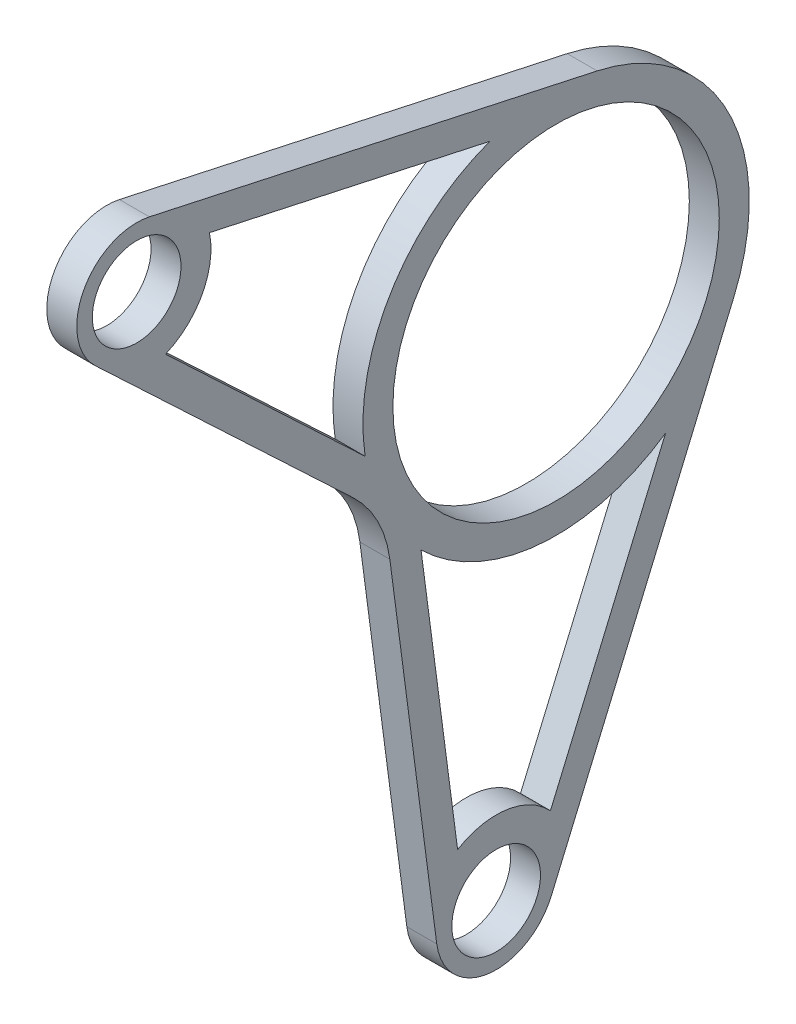
ISO-10303-21;
HEADER;
FILE_DESCRIPTION(('STEP AP214'),'2;1');
FILE_NAME('part.step','',(''),(''),'','','');
FILE_SCHEMA(('AUTOMOTIVE_DESIGN { 1 0 10303 214 1 1 1 1 }'));
ENDSEC;
DATA;
#1=APPLICATION_CONTEXT('core data for automotive mechanical design processes');
#2=APPLICATION_PROTOCOL_DEFINITION('international standard','automotive_design',2000,#1);
#3=PRODUCT_CONTEXT('',#1,'mechanical');
#4=PRODUCT('Part','Part','',(#3));
#5=PRODUCT_RELATED_PRODUCT_CATEGORY('part','',(#4));
#6=PRODUCT_DEFINITION_FORMATION('','',#4);
#7=PRODUCT_DEFINITION_CONTEXT('part definition',#1,'design');
#8=PRODUCT_DEFINITION('design','',#6,#7);
#9=PRODUCT_DEFINITION_SHAPE('','',#8);
#10=(LENGTH_UNIT() NAMED_UNIT(*) SI_UNIT(.MILLI.,.METRE.));
#11=(NAMED_UNIT(*) PLANE_ANGLE_UNIT() SI_UNIT($,.RADIAN.));
#12=(NAMED_UNIT(*) SI_UNIT($,.STERADIAN.) SOLID_ANGLE_UNIT());
#13=UNCERTAINTY_MEASURE_WITH_UNIT(LENGTH_MEASURE(1.E-05),#10,'distance_accuracy_value','');
#14=(GEOMETRIC_REPRESENTATION_CONTEXT(3) GLOBAL_UNCERTAINTY_ASSIGNED_CONTEXT((#13)) GLOBAL_UNIT_ASSIGNED_CONTEXT((#10,
#11,#12)) REPRESENTATION_CONTEXT('',''));
#15=CARTESIAN_POINT('',(0.,0.,0.));
#16=DIRECTION('',(0.,0.,1.));
#17=DIRECTION('',(1.,0.,0.));
#18=AXIS2_PLACEMENT_3D('',#15,#16,#17);
#19=CARTESIAN_POINT('',(-98.425,35.2126571367214,-267.637777540096));
#20=DIRECTION('',(0.,0.130444171254395,-0.991455656187282));
#21=DIRECTION('',(0.,0.991455656187282,0.130444171254395));
#22=AXIS2_PLACEMENT_3D('',#19,#20,#21);
#23=PLANE('',#22);
#24=DIRECTION('',(0.,-0.991455656187282,-0.130444171254395));
#25=VECTOR('',#24,1.);
#26=CARTESIAN_POINT('',(-98.425,35.2126571367214,-267.637777540096));
#27=LINE('',#26,#25);
#28=CARTESIAN_POINT('',(-98.425,213.631856854653,-244.163460259404));
#29=VERTEX_POINT('',#28);
#30=CARTESIAN_POINT('',(-98.425,138.043359025069,-254.108513166421));
#31=VERTEX_POINT('',#30);
#32=EDGE_CURVE('E227',#29,#31,#27,.T.);
#33=ORIENTED_EDGE('',*,*,#32,.F.);
#34=DIRECTION('',(-1.,0.,0.));
#35=VECTOR('',#34,1.);
#36=CARTESIAN_POINT('',(-104.775,213.631856854653,-244.163460259404));
#37=LINE('',#36,#35);
#38=CARTESIAN_POINT('',(-104.775,213.631856854653,-244.163460259404));
#39=VERTEX_POINT('',#38);
#40=EDGE_CURVE('E283',#29,#39,#37,.T.);
#41=ORIENTED_EDGE('',*,*,#40,.T.);
#42=DIRECTION('',(0.,-0.991455656187282,-0.130444171254395));
#43=VECTOR('',#42,1.);
#44=CARTESIAN_POINT('',(-104.775,35.2126571367214,-267.637777540096));
#45=LINE('',#44,#43);
#46=CARTESIAN_POINT('',(-104.775,138.043359025069,-254.108513166421));
#47=VERTEX_POINT('',#46);
#48=EDGE_CURVE('E252',#39,#47,#45,.T.);
#49=ORIENTED_EDGE('',*,*,#48,.T.);
#50=DIRECTION('',(-1.,0.,0.));
#51=VECTOR('',#50,1.);
#52=CARTESIAN_POINT('',(-98.425,138.043359025069,-254.108513166421));
#53=LINE('',#52,#51);
#54=EDGE_CURVE('E280',#31,#47,#53,.T.);
#55=ORIENTED_EDGE('',*,*,#54,.F.);
#56=EDGE_LOOP('',(#33,#41,#49,#55));
#57=FACE_BOUND('',#56,.T.);
#58=ADVANCED_FACE('F35',(#57),#23,.F.);
#59=CARTESIAN_POINT('',(-98.425,139.7,-266.7));
#60=DIRECTION('',(-1.,0.,0.));
#61=DIRECTION('',(0.,0.,1.));
#62=AXIS2_PLACEMENT_3D('',#59,#60,#61);
#63=CYLINDRICAL_SURFACE('',#62,12.7);
#64=CARTESIAN_POINT('',(-104.775,139.7,-266.7));
#65=DIRECTION('',(1.,0.,0.));
#66=DIRECTION('',(0.,0.,-1.));
#67=AXIS2_PLACEMENT_3D('',#64,#65,#66);
#68=CIRCLE('',#67,12.7);
#69=CARTESIAN_POINT('',(-104.775,134.710232546797,-278.378708009149));
#70=VERTEX_POINT('',#69);
#71=EDGE_CURVE('E254',#47,#70,#68,.T.);
#72=ORIENTED_EDGE('',*,*,#71,.T.);
#73=DIRECTION('',(-1.,0.,0.));
#74=VECTOR('',#73,1.);
#75=CARTESIAN_POINT('',(-98.425,134.710232546797,-278.378708009149));
#76=LINE('',#75,#74);
#77=CARTESIAN_POINT('',(-98.425,134.710232546797,-278.378708009149));
#78=VERTEX_POINT('',#77);
#79=EDGE_CURVE('E277',#78,#70,#76,.T.);
#80=ORIENTED_EDGE('',*,*,#79,.F.);
#81=CARTESIAN_POINT('',(-98.425,139.7,-266.7));
#82=DIRECTION('',(1.,0.,0.));
#83=DIRECTION('',(0.,0.,-1.));
#84=AXIS2_PLACEMENT_3D('',#81,#82,#83);
#85=CIRCLE('',#84,12.7);
#86=EDGE_CURVE('E229',#31,#78,#85,.T.);
#87=ORIENTED_EDGE('',*,*,#86,.F.);
#88=ORIENTED_EDGE('',*,*,#54,.T.);
#89=EDGE_LOOP('',(#72,#80,#87,#88));
#90=FACE_BOUND('',#89,.T.);
#91=ADVANCED_FACE('F307',(#90),#63,.T.);
#92=CARTESIAN_POINT('',(-98.425,-79.7834058707051,-186.735576332567));
#93=DIRECTION('',(0.,0.392895075055363,0.919583307806987));
#94=DIRECTION('',(0.,-0.919583307806987,0.392895075055363));
#95=AXIS2_PLACEMENT_3D('',#92,#93,#94);
#96=PLANE('',#95);
#97=DIRECTION('',(0.,0.919583307806987,-0.392895075055363));
#98=VECTOR('',#97,1.);
#99=CARTESIAN_POINT('',(-104.775,-79.7834058707051,-186.735576332567));
#100=LINE('',#99,#98);
#101=CARTESIAN_POINT('',(-104.775,225.215098942321,-317.047217945617));
#102=VERTEX_POINT('',#101);
#103=EDGE_CURVE('E256',#70,#102,#100,.T.);
#104=ORIENTED_EDGE('',*,*,#103,.T.);
#105=DIRECTION('',(-1.,0.,0.));
#106=VECTOR('',#105,1.);
#107=CARTESIAN_POINT('',(-98.425,225.215098942321,-317.047217945617));
#108=LINE('',#107,#106);
#109=CARTESIAN_POINT('',(-98.425,225.215098942321,-317.047217945617));
#110=VERTEX_POINT('',#109);
#111=EDGE_CURVE('E275',#110,#102,#108,.T.);
#112=ORIENTED_EDGE('',*,*,#111,.F.);
#113=DIRECTION('',(0.,0.919583307806987,-0.392895075055363));
#114=VECTOR('',#113,1.);
#115=CARTESIAN_POINT('',(-98.425,-79.7834058707051,-186.735576332567));
#116=LINE('',#115,#114);
#117=EDGE_CURVE('E231',#78,#110,#116,.T.);
#118=ORIENTED_EDGE('',*,*,#117,.F.);
#119=ORIENTED_EDGE('',*,*,#79,.T.);
#120=EDGE_LOOP('',(#104,#112,#118,#119));
#121=FACE_BOUND('',#120,.T.);
#122=ADVANCED_FACE('F313',(#121),#96,.F.);
#123=CARTESIAN_POINT('',(-98.425,241.3,-279.4));
#124=DIRECTION('',(-1.,0.,0.));
#125=DIRECTION('',(0.,0.,1.));
#126=AXIS2_PLACEMENT_3D('',#123,#124,#125);
#127=CYLINDRICAL_SURFACE('',#126,40.9394316164762);
#128=CARTESIAN_POINT('',(-104.775,241.3,-279.4));
#129=DIRECTION('',(1.,0.,0.));
#130=DIRECTION('',(0.,0.,-1.));
#131=AXIS2_PLACEMENT_3D('',#128,#129,#130);
#132=CIRCLE('',#131,40.9394316164762);
#133=CARTESIAN_POINT('',(-104.775,281.30198878663,-288.110795267625));
#134=VERTEX_POINT('',#133);
#135=EDGE_CURVE('E259',#134,#102,#132,.F.);
#136=ORIENTED_EDGE('',*,*,#135,.F.);
#137=DIRECTION('',(-1.,0.,0.));
#138=VECTOR('',#137,1.);
#139=CARTESIAN_POINT('',(-98.425,281.30198878663,-288.110795267625));
#140=LINE('',#139,#138);
#141=CARTESIAN_POINT('',(-98.425,281.30198878663,-288.110795267625));
#142=VERTEX_POINT('',#141);
#143=EDGE_CURVE('E273',#142,#134,#140,.T.);
#144=ORIENTED_EDGE('',*,*,#143,.F.);
#145=CARTESIAN_POINT('',(-98.425,241.3,-279.4));
#146=DIRECTION('',(1.,0.,0.));
#147=DIRECTION('',(0.,0.,-1.));
#148=AXIS2_PLACEMENT_3D('',#145,#146,#147);
#149=CIRCLE('',#148,40.9394316164762);
#150=EDGE_CURVE('E233',#142,#110,#149,.F.);
#151=ORIENTED_EDGE('',*,*,#150,.T.);
#152=ORIENTED_EDGE('',*,*,#111,.T.);
#153=EDGE_LOOP('',(#136,#144,#151,#152));
#154=FACE_BOUND('',#153,.T.);
#155=ADVANCED_FACE('F317',(#154),#127,.T.);
#156=CARTESIAN_POINT('',(-98.425,328.465228610363,-71.5262777113434));
#157=DIRECTION('',(0.,-0.977101713608814,0.212772745582509));
#158=DIRECTION('',(0.,-0.212772745582509,-0.977101713608814));
#159=AXIS2_PLACEMENT_3D('',#156,#157,#158);
#160=PLANE('',#159);
#161=DIRECTION('',(0.,0.21277274558251,0.977101713608814));
#162=VECTOR('',#161,1.);
#163=CARTESIAN_POINT('',(-104.775,328.465228610363,-71.5262777113434));
#164=LINE('',#163,#162);
#165=CARTESIAN_POINT('',(-104.775,301.969191762832,-193.202213868898));
#166=VERTEX_POINT('',#165);
#167=EDGE_CURVE('E262',#134,#166,#164,.T.);
#168=ORIENTED_EDGE('',*,*,#167,.T.);
#169=DIRECTION('',(-1.,0.,0.));
#170=VECTOR('',#169,1.);
#171=CARTESIAN_POINT('',(-98.425,301.969191762832,-193.202213868898));
#172=LINE('',#171,#170);
#173=CARTESIAN_POINT('',(-98.425,301.969191762832,-193.202213868898));
#174=VERTEX_POINT('',#173);
#175=EDGE_CURVE('E270',#174,#166,#172,.T.);
#176=ORIENTED_EDGE('',*,*,#175,.F.);
#177=DIRECTION('',(0.,0.21277274558251,0.977101713608814));
#178=VECTOR('',#177,1.);
#179=CARTESIAN_POINT('',(-98.425,328.465228610363,-71.5262777113434));
#180=LINE('',#179,#178);
#181=EDGE_CURVE('E236',#142,#174,#180,.T.);
#182=ORIENTED_EDGE('',*,*,#181,.F.);
#183=ORIENTED_EDGE('',*,*,#143,.T.);
#184=EDGE_LOOP('',(#168,#176,#182,#183));
#185=FACE_BOUND('',#184,.T.);
#186=ADVANCED_FACE('F322',(#185),#160,.F.);
#187=CARTESIAN_POINT('',(-98.425,289.56,-190.5));
#188=DIRECTION('',(-1.,0.,0.));
#189=DIRECTION('',(0.,0.,1.));
#190=AXIS2_PLACEMENT_3D('',#187,#188,#189);
#191=CYLINDRICAL_SURFACE('',#190,12.7);
#192=CARTESIAN_POINT('',(-104.775,289.56,-190.5));
#193=DIRECTION('',(1.,0.,0.));
#194=DIRECTION('',(0.,0.,-1.));
#195=AXIS2_PLACEMENT_3D('',#192,#193,#194);
#196=CIRCLE('',#195,12.7);
#197=CARTESIAN_POINT('',(-104.775,280.321615273653,-181.78551506697));
#198=VERTEX_POINT('',#197);
#199=EDGE_CURVE('E264',#166,#198,#196,.T.);
#200=ORIENTED_EDGE('',*,*,#199,.T.);
#201=DIRECTION('',(-1.,0.,0.));
#202=VECTOR('',#201,1.);
#203=CARTESIAN_POINT('',(-98.425,280.321615273653,-181.78551506697));
#204=LINE('',#203,#202);
#205=CARTESIAN_POINT('',(-98.425,280.321615273653,-181.78551506697));
#206=VERTEX_POINT('',#205);
#207=EDGE_CURVE('E243',#206,#198,#204,.T.);
#208=ORIENTED_EDGE('',*,*,#207,.F.);
#209=CARTESIAN_POINT('',(-98.425,289.56,-190.5));
#210=DIRECTION('',(1.,0.,0.));
#211=DIRECTION('',(0.,0.,-1.));
#212=AXIS2_PLACEMENT_3D('',#209,#210,#211);
#213=CIRCLE('',#212,12.7);
#214=EDGE_CURVE('E238',#174,#206,#213,.T.);
#215=ORIENTED_EDGE('',*,*,#214,.F.);
#216=ORIENTED_EDGE('',*,*,#175,.T.);
#217=EDGE_LOOP('',(#200,#208,#215,#216));
#218=FACE_BOUND('',#217,.T.);
#219=ADVANCED_FACE('F325',(#218),#191,.T.);
#220=CARTESIAN_POINT('',(-98.425,289.56,-190.5));
#221=DIRECTION('',(-1.,0.,0.));
#222=DIRECTION('',(0.,0.,1.));
#223=AXIS2_PLACEMENT_3D('',#220,#221,#222);
#224=CYLINDRICAL_SURFACE('',#223,9.39799999999998);
#225=CARTESIAN_POINT('',(-98.425,289.56,-190.5));
#226=DIRECTION('',(1.,0.,0.));
#227=DIRECTION('',(0.,0.,-1.));
#228=AXIS2_PLACEMENT_3D('',#225,#226,#227);
#229=CIRCLE('',#228,9.39799999999998);
#230=CARTESIAN_POINT('',(-98.425,289.56,-199.898));
#231=VERTEX_POINT('',#230);
#232=EDGE_CURVE('E224',#231,#231,#229,.T.);
#233=ORIENTED_EDGE('',*,*,#232,.T.);
#234=EDGE_LOOP('',(#233));
#235=FACE_BOUND('',#234,.T.);
#236=CARTESIAN_POINT('',(-104.775,289.56,-190.5));
#237=DIRECTION('',(1.,0.,0.));
#238=DIRECTION('',(0.,0.,-1.));
#239=AXIS2_PLACEMENT_3D('',#236,#237,#238);
#240=CIRCLE('',#239,9.39799999999998);
#241=CARTESIAN_POINT('',(-104.775,289.56,-199.898));
#242=VERTEX_POINT('',#241);
#243=EDGE_CURVE('E249',#242,#242,#240,.T.);
#244=ORIENTED_EDGE('',*,*,#243,.F.);
#245=EDGE_LOOP('',(#244));
#246=FACE_BOUND('',#245,.T.);
#247=ADVANCED_FACE('F327',(#235,#246),#224,.F.);
#248=CARTESIAN_POINT('',(-98.425,241.3,-279.4));
#249=DIRECTION('',(-1.,0.,0.));
#250=DIRECTION('',(0.,0.,1.));
#251=AXIS2_PLACEMENT_3D('',#248,#249,#250);
#252=CYLINDRICAL_SURFACE('',#251,34.5894316164762);
#253=CARTESIAN_POINT('',(-98.425,241.3,-279.4));
#254=DIRECTION('',(1.,0.,0.));
#255=DIRECTION('',(0.,0.,-1.));
#256=AXIS2_PLACEMENT_3D('',#253,#254,#255);
#257=CIRCLE('',#256,34.5894316164762);
#258=CARTESIAN_POINT('',(-98.425,241.3,-313.989431616476));
#259=VERTEX_POINT('',#258);
#260=EDGE_CURVE('E220',#259,#259,#257,.T.);
#261=ORIENTED_EDGE('',*,*,#260,.T.);
#262=EDGE_LOOP('',(#261));
#263=FACE_BOUND('',#262,.T.);
#264=CARTESIAN_POINT('',(-104.775,241.3,-279.4));
#265=DIRECTION('',(1.,0.,0.));
#266=DIRECTION('',(0.,0.,-1.));
#267=AXIS2_PLACEMENT_3D('',#264,#265,#266);
#268=CIRCLE('',#267,34.5894316164762);
#269=CARTESIAN_POINT('',(-104.775,241.3,-313.989431616476));
#270=VERTEX_POINT('',#269);
#271=EDGE_CURVE('E246',#270,#270,#268,.T.);
#272=ORIENTED_EDGE('',*,*,#271,.F.);
#273=EDGE_LOOP('',(#272));
#274=FACE_BOUND('',#273,.T.);
#275=ADVANCED_FACE('F333',(#263,#274),#252,.F.);
#276=CARTESIAN_POINT('',(-98.425,139.7,-266.7));
#277=DIRECTION('',(-1.,0.,0.));
#278=DIRECTION('',(0.,0.,1.));
#279=AXIS2_PLACEMENT_3D('',#276,#277,#278);
#280=CYLINDRICAL_SURFACE('',#279,9.39800000000001);
#281=CARTESIAN_POINT('',(-98.425,139.7,-266.7));
#282=DIRECTION('',(1.,0.,0.));
#283=DIRECTION('',(0.,0.,-1.));
#284=AXIS2_PLACEMENT_3D('',#281,#282,#283);
#285=CIRCLE('',#284,9.39800000000001);
#286=CARTESIAN_POINT('',(-98.425,139.7,-276.098));
#287=VERTEX_POINT('',#286);
#288=EDGE_CURVE('E217',#287,#287,#285,.T.);
#289=ORIENTED_EDGE('',*,*,#288,.T.);
#290=EDGE_LOOP('',(#289));
#291=FACE_BOUND('',#290,.T.);
#292=CARTESIAN_POINT('',(-104.775,139.7,-266.7));
#293=DIRECTION('',(1.,0.,0.));
#294=DIRECTION('',(0.,0.,-1.));
#295=AXIS2_PLACEMENT_3D('',#292,#293,#294);
#296=CIRCLE('',#295,9.39800000000001);
#297=CARTESIAN_POINT('',(-104.775,139.7,-276.098));
#298=VERTEX_POINT('',#297);
#299=EDGE_CURVE('E184',#298,#298,#296,.T.);
#300=ORIENTED_EDGE('',*,*,#299,.F.);
#301=EDGE_LOOP('',(#300));
#302=FACE_BOUND('',#301,.T.);
#303=ADVANCED_FACE('F347',(#291,#302),#280,.F.);
#304=CARTESIAN_POINT('',(-98.425,239.072262610238,-225.514707617753));
#305=DIRECTION('',(0.,0.727431868216255,-0.686179915986623));
#306=DIRECTION('',(0.,0.686179915986623,0.727431868216255));
#307=AXIS2_PLACEMENT_3D('',#304,#305,#306);
#308=PLANE('',#307);
#309=DIRECTION('',(0.,-0.686179915986623,-0.727431868216255));
#310=VECTOR('',#309,1.);
#311=CARTESIAN_POINT('',(-104.775,239.072262610238,-225.514707617753));
#312=LINE('',#311,#310);
#313=CARTESIAN_POINT('',(-104.775,228.795344357484,-236.409456458307));
#314=VERTEX_POINT('',#313);
#315=EDGE_CURVE('E221',#198,#314,#312,.T.);
#316=ORIENTED_EDGE('',*,*,#315,.T.);
#317=DIRECTION('',(-1.,0.,0.));
#318=VECTOR('',#317,1.);
#319=CARTESIAN_POINT('',(-98.425,228.795344357484,-236.409456458307));
#320=LINE('',#319,#318);
#321=CARTESIAN_POINT('',(-98.425,228.795344357484,-236.409456458307));
#322=VERTEX_POINT('',#321);
#323=EDGE_CURVE('E286',#314,#322,#320,.F.);
#324=ORIENTED_EDGE('',*,*,#323,.T.);
#325=DIRECTION('',(0.,-0.686179915986623,-0.727431868216255));
#326=VECTOR('',#325,1.);
#327=CARTESIAN_POINT('',(-98.425,239.072262610238,-225.514707617753));
#328=LINE('',#327,#326);
#329=EDGE_CURVE('E240',#206,#322,#328,.T.);
#330=ORIENTED_EDGE('',*,*,#329,.F.);
#331=ORIENTED_EDGE('',*,*,#207,.T.);
#332=EDGE_LOOP('',(#316,#324,#330,#331));
#333=FACE_BOUND('',#332,.T.);
#334=ADVANCED_FACE('F296',(#333),#308,.F.);
#335=CARTESIAN_POINT('',(-98.425,0.,0.));
#336=DIRECTION('',(1.,0.,0.));
#337=DIRECTION('',(0.,0.,-1.));
#338=AXIS2_PLACEMENT_3D('',#335,#336,#337);
#339=PLANE('',#338);
#340=CARTESIAN_POINT('',(-98.425,289.56,-190.5));
#341=DIRECTION('',(-1.,0.,0.));
#342=DIRECTION('',(0.,0.,1.));
#343=AXIS2_PLACEMENT_3D('',#340,#341,#342);
#344=CIRCLE('',#343,15.748);
#345=CARTESIAN_POINT('',(-98.425,292.698327232095,-205.932122543069));
#346=VERTEX_POINT('',#345);
#347=CARTESIAN_POINT('',(-98.425,275.052266891521,-196.625780281167));
#348=VERTEX_POINT('',#347);
#349=EDGE_CURVE('E50',#346,#348,#344,.T.);
#350=ORIENTED_EDGE('',*,*,#349,.F.);
#351=DIRECTION('',(0.,0.212772745582508,0.977101713608814));
#352=VECTOR('',#351,1.);
#353=CARTESIAN_POINT('',(-98.425,279.757107685433,-265.361199141267));
#354=LINE('',#353,#352);
#355=CARTESIAN_POINT('',(-98.425,279.757107685433,-265.361199141267));
#356=VERTEX_POINT('',#355);
#357=EDGE_CURVE('E168',#356,#346,#354,.T.);
#358=ORIENTED_EDGE('',*,*,#357,.F.);
#359=CARTESIAN_POINT('',(-98.425,241.3,-279.4));
#360=DIRECTION('',(-1.,0.,0.));
#361=DIRECTION('',(0.,0.,-1.));
#362=AXIS2_PLACEMENT_3D('',#359,#360,#361);
#363=CIRCLE('',#362,40.9394316164762);
#364=CARTESIAN_POINT('',(-98.425,235.151944416099,-238.924841277428));
#365=VERTEX_POINT('',#364);
#366=EDGE_CURVE('E171',#365,#356,#363,.T.);
#367=ORIENTED_EDGE('',*,*,#366,.F.);
#368=DIRECTION('',(0.,-0.686179915986624,-0.727431868216254));
#369=VECTOR('',#368,1.);
#370=CARTESIAN_POINT('',(-98.425,275.052266891521,-196.625780281167));
#371=LINE('',#370,#369);
#372=EDGE_CURVE('E177',#348,#365,#371,.T.);
#373=ORIENTED_EDGE('',*,*,#372,.F.);
#374=EDGE_LOOP('',(#350,#358,#367,#373));
#375=FACE_BOUND('',#374,.T.);
#376=CARTESIAN_POINT('',(-98.425,241.3,-279.4));
#377=DIRECTION('',(-1.,0.,0.));
#378=DIRECTION('',(0.,0.,-1.));
#379=AXIS2_PLACEMENT_3D('',#376,#377,#378);
#380=CIRCLE('',#379,40.9394316164762);
#381=CARTESIAN_POINT('',(-98.425,207.571144307365,-302.603477212383));
#382=VERTEX_POINT('',#381);
#383=CARTESIAN_POINT('',(-98.425,212.027275618194,-250.779296508525));
#384=VERTEX_POINT('',#383);
#385=EDGE_CURVE('E58',#382,#384,#380,.T.);
#386=ORIENTED_EDGE('',*,*,#385,.F.);
#387=DIRECTION('',(0.,0.919583307806988,-0.392895075055362));
#388=VECTOR('',#387,1.);
#389=CARTESIAN_POINT('',(-98.425,150.45723397037,-278.201366062635));
#390=LINE('',#389,#388);
#391=CARTESIAN_POINT('',(-98.425,150.45723397037,-278.201366062635));
#392=VERTEX_POINT('',#391);
#393=EDGE_CURVE('E192',#392,#382,#390,.T.);
#394=ORIENTED_EDGE('',*,*,#393,.F.);
#395=CARTESIAN_POINT('',(-98.425,139.7,-266.7));
#396=DIRECTION('',(-1.,0.,0.));
#397=DIRECTION('',(0.,0.,1.));
#398=AXIS2_PLACEMENT_3D('',#395,#396,#397);
#399=CIRCLE('',#398,15.748);
#400=CARTESIAN_POINT('',(-98.425,153.159549828988,-258.524425255618));
#401=VERTEX_POINT('',#400);
#402=EDGE_CURVE('E206',#401,#392,#399,.T.);
#403=ORIENTED_EDGE('',*,*,#402,.F.);
#404=DIRECTION('',(0.,-0.991455656187282,-0.130444171254395));
#405=VECTOR('',#404,1.);
#406=CARTESIAN_POINT('',(-98.425,212.027275618193,-250.779296508525));
#407=LINE('',#406,#405);
#408=EDGE_CURVE('E203',#384,#401,#407,.T.);
#409=ORIENTED_EDGE('',*,*,#408,.F.);
#410=EDGE_LOOP('',(#386,#394,#403,#409));
#411=FACE_BOUND('',#410,.T.);
#412=ORIENTED_EDGE('',*,*,#288,.F.);
#413=EDGE_LOOP('',(#412));
#414=FACE_BOUND('',#413,.T.);
#415=ORIENTED_EDGE('',*,*,#260,.F.);
#416=EDGE_LOOP('',(#415));
#417=FACE_BOUND('',#416,.T.);
#418=ORIENTED_EDGE('',*,*,#232,.F.);
#419=EDGE_LOOP('',(#418));
#420=FACE_BOUND('',#419,.T.);
#421=ORIENTED_EDGE('',*,*,#329,.T.);
#422=CARTESIAN_POINT('',(-98.425,210.318574904791,-218.980486592247));
#423=DIRECTION('',(1.,0.,0.));
#424=DIRECTION('',(0.,0.,-1.));
#425=AXIS2_PLACEMENT_3D('',#422,#423,#424);
#426=CIRCLE('',#425,25.4);
#427=EDGE_CURVE('E11',#322,#29,#426,.F.);
#428=ORIENTED_EDGE('',*,*,#427,.T.);
#429=ORIENTED_EDGE('',*,*,#32,.T.);
#430=ORIENTED_EDGE('',*,*,#86,.T.);
#431=ORIENTED_EDGE('',*,*,#117,.T.);
#432=ORIENTED_EDGE('',*,*,#150,.F.);
#433=ORIENTED_EDGE('',*,*,#181,.T.);
#434=ORIENTED_EDGE('',*,*,#214,.T.);
#435=EDGE_LOOP('',(#421,#428,#429,#430,#431,#432,#433,#434));
#436=FACE_BOUND('',#435,.T.);
#437=ADVANCED_FACE('F302',(#375,#411,#414,#417,#420,#436),#339,.T.);
#438=CARTESIAN_POINT('',(-104.775,0.,0.));
#439=DIRECTION('',(1.,0.,0.));
#440=DIRECTION('',(0.,0.,-1.));
#441=AXIS2_PLACEMENT_3D('',#438,#439,#440);
#442=PLANE('',#441);
#443=DIRECTION('',(0.,0.212772745582508,0.977101713608814));
#444=VECTOR('',#443,1.);
#445=CARTESIAN_POINT('',(-104.775,279.757107685433,-265.361199141267));
#446=LINE('',#445,#444);
#447=CARTESIAN_POINT('',(-104.775,279.757107685433,-265.361199141267));
#448=VERTEX_POINT('',#447);
#449=CARTESIAN_POINT('',(-104.775,292.698327232095,-205.932122543069));
#450=VERTEX_POINT('',#449);
#451=EDGE_CURVE('E155',#448,#450,#446,.T.);
#452=ORIENTED_EDGE('',*,*,#451,.T.);
#453=CARTESIAN_POINT('',(-104.775,289.56,-190.5));
#454=DIRECTION('',(-1.,0.,0.));
#455=DIRECTION('',(0.,0.,1.));
#456=AXIS2_PLACEMENT_3D('',#453,#454,#455);
#457=CIRCLE('',#456,15.748);
#458=CARTESIAN_POINT('',(-104.775,275.052266891521,-196.625780281167));
#459=VERTEX_POINT('',#458);
#460=EDGE_CURVE('E149',#450,#459,#457,.T.);
#461=ORIENTED_EDGE('',*,*,#460,.T.);
#462=DIRECTION('',(0.,-0.686179915986624,-0.727431868216254));
#463=VECTOR('',#462,1.);
#464=CARTESIAN_POINT('',(-104.775,275.052266891521,-196.625780281167));
#465=LINE('',#464,#463);
#466=CARTESIAN_POINT('',(-104.775,235.151944416098,-238.924841277428));
#467=VERTEX_POINT('',#466);
#468=EDGE_CURVE('E159',#459,#467,#465,.T.);
#469=ORIENTED_EDGE('',*,*,#468,.T.);
#470=CARTESIAN_POINT('',(-104.775,241.3,-279.4));
#471=DIRECTION('',(-1.,0.,0.));
#472=DIRECTION('',(0.,0.,-1.));
#473=AXIS2_PLACEMENT_3D('',#470,#471,#472);
#474=CIRCLE('',#473,40.9394316164762);
#475=EDGE_CURVE('E163',#467,#448,#474,.T.);
#476=ORIENTED_EDGE('',*,*,#475,.T.);
#477=EDGE_LOOP('',(#452,#461,#469,#476));
#478=FACE_BOUND('',#477,.T.);
#479=DIRECTION('',(0.,0.919583307806988,-0.392895075055362));
#480=VECTOR('',#479,1.);
#481=CARTESIAN_POINT('',(-104.775,150.45723397037,-278.201366062635));
#482=LINE('',#481,#480);
#483=CARTESIAN_POINT('',(-104.775,150.45723397037,-278.201366062635));
#484=VERTEX_POINT('',#483);
#485=CARTESIAN_POINT('',(-104.775,207.571144307365,-302.603477212383));
#486=VERTEX_POINT('',#485);
#487=EDGE_CURVE('E198',#484,#486,#482,.T.);
#488=ORIENTED_EDGE('',*,*,#487,.T.);
#489=CARTESIAN_POINT('',(-104.775,241.3,-279.4));
#490=DIRECTION('',(-1.,0.,0.));
#491=DIRECTION('',(0.,0.,-1.));
#492=AXIS2_PLACEMENT_3D('',#489,#490,#491);
#493=CIRCLE('',#492,40.9394316164762);
#494=CARTESIAN_POINT('',(-104.775,212.027275618193,-250.779296508525));
#495=VERTEX_POINT('',#494);
#496=EDGE_CURVE('E188',#486,#495,#493,.T.);
#497=ORIENTED_EDGE('',*,*,#496,.T.);
#498=DIRECTION('',(0.,-0.991455656187282,-0.130444171254395));
#499=VECTOR('',#498,1.);
#500=CARTESIAN_POINT('',(-104.775,212.027275618193,-250.779296508525));
#501=LINE('',#500,#499);
#502=CARTESIAN_POINT('',(-104.775,153.159549828988,-258.524425255618));
#503=VERTEX_POINT('',#502);
#504=EDGE_CURVE('E191',#495,#503,#501,.T.);
#505=ORIENTED_EDGE('',*,*,#504,.T.);
#506=CARTESIAN_POINT('',(-104.775,139.7,-266.7));
#507=DIRECTION('',(-1.,0.,0.));
#508=DIRECTION('',(0.,0.,1.));
#509=AXIS2_PLACEMENT_3D('',#506,#507,#508);
#510=CIRCLE('',#509,15.748);
#511=EDGE_CURVE('E195',#503,#484,#510,.T.);
#512=ORIENTED_EDGE('',*,*,#511,.T.);
#513=EDGE_LOOP('',(#488,#497,#505,#512));
#514=FACE_BOUND('',#513,.T.);
#515=ORIENTED_EDGE('',*,*,#299,.T.);
#516=EDGE_LOOP('',(#515));
#517=FACE_BOUND('',#516,.T.);
#518=ORIENTED_EDGE('',*,*,#271,.T.);
#519=EDGE_LOOP('',(#518));
#520=FACE_BOUND('',#519,.T.);
#521=ORIENTED_EDGE('',*,*,#243,.T.);
#522=EDGE_LOOP('',(#521));
#523=FACE_BOUND('',#522,.T.);
#524=ORIENTED_EDGE('',*,*,#48,.F.);
#525=CARTESIAN_POINT('',(-104.775,210.318574904791,-218.980486592247));
#526=DIRECTION('',(1.,0.,0.));
#527=DIRECTION('',(0.,0.,-1.));
#528=AXIS2_PLACEMENT_3D('',#525,#526,#527);
#529=CIRCLE('',#528,25.4);
#530=EDGE_CURVE('E43',#39,#314,#529,.T.);
#531=ORIENTED_EDGE('',*,*,#530,.T.);
#532=ORIENTED_EDGE('',*,*,#315,.F.);
#533=ORIENTED_EDGE('',*,*,#199,.F.);
#534=ORIENTED_EDGE('',*,*,#167,.F.);
#535=ORIENTED_EDGE('',*,*,#135,.T.);
#536=ORIENTED_EDGE('',*,*,#103,.F.);
#537=ORIENTED_EDGE('',*,*,#71,.F.);
#538=EDGE_LOOP('',(#524,#531,#532,#533,#534,#535,#536,#537));
#539=FACE_BOUND('',#538,.T.);
#540=ADVANCED_FACE('F165',(#478,#514,#517,#520,#523,#539),#442,.F.);
#541=CARTESIAN_POINT('',(-98.425,210.318574904791,-218.980486592247));
#542=DIRECTION('',(1.,0.,0.));
#543=DIRECTION('',(0.,0.,-1.));
#544=AXIS2_PLACEMENT_3D('',#541,#542,#543);
#545=CYLINDRICAL_SURFACE('',#544,25.4);
#546=ORIENTED_EDGE('',*,*,#427,.F.);
#547=ORIENTED_EDGE('',*,*,#323,.F.);
#548=ORIENTED_EDGE('',*,*,#530,.F.);
#549=ORIENTED_EDGE('',*,*,#40,.F.);
#550=EDGE_LOOP('',(#546,#547,#548,#549));
#551=FACE_BOUND('',#550,.T.);
#552=ADVANCED_FACE('F37',(#551),#545,.F.);
#553=CARTESIAN_POINT('',(-104.775,241.3,-279.4));
#554=DIRECTION('',(1.,0.,0.));
#555=DIRECTION('',(0.,0.,-1.));
#556=AXIS2_PLACEMENT_3D('',#553,#554,#555);
#557=CYLINDRICAL_SURFACE('',#556,40.9394316164762);
#558=ORIENTED_EDGE('',*,*,#385,.T.);
#559=DIRECTION('',(1.,0.,0.));
#560=VECTOR('',#559,1.);
#561=CARTESIAN_POINT('',(-104.775,212.027275618193,-250.779296508525));
#562=LINE('',#561,#560);
#563=EDGE_CURVE('E201',#495,#384,#562,.T.);
#564=ORIENTED_EDGE('',*,*,#563,.F.);
#565=ORIENTED_EDGE('',*,*,#496,.F.);
#566=DIRECTION('',(1.,0.,0.));
#567=VECTOR('',#566,1.);
#568=CARTESIAN_POINT('',(-104.775,207.571144307365,-302.603477212383));
#569=LINE('',#568,#567);
#570=EDGE_CURVE('E178',#486,#382,#569,.T.);
#571=ORIENTED_EDGE('',*,*,#570,.T.);
#572=EDGE_LOOP('',(#558,#564,#565,#571));
#573=FACE_BOUND('',#572,.T.);
#574=ADVANCED_FACE('F370',(#573),#557,.T.);
#575=CARTESIAN_POINT('',(-104.775,150.45723397037,-278.201366062635));
#576=DIRECTION('',(0.,-0.392895075055362,-0.919583307806988));
#577=DIRECTION('',(0.,0.919583307806988,-0.392895075055362));
#578=AXIS2_PLACEMENT_3D('',#575,#576,#577);
#579=PLANE('',#578);
#580=ORIENTED_EDGE('',*,*,#393,.T.);
#581=ORIENTED_EDGE('',*,*,#570,.F.);
#582=ORIENTED_EDGE('',*,*,#487,.F.);
#583=DIRECTION('',(1.,0.,0.));
#584=VECTOR('',#583,1.);
#585=CARTESIAN_POINT('',(-104.775,150.45723397037,-278.201366062635));
#586=LINE('',#585,#584);
#587=EDGE_CURVE('E212',#484,#392,#586,.T.);
#588=ORIENTED_EDGE('',*,*,#587,.T.);
#589=EDGE_LOOP('',(#580,#581,#582,#588));
#590=FACE_BOUND('',#589,.T.);
#591=ADVANCED_FACE('F376',(#590),#579,.F.);
#592=CARTESIAN_POINT('',(-104.775,139.7,-266.7));
#593=DIRECTION('',(1.,0.,0.));
#594=DIRECTION('',(0.,0.,-1.));
#595=AXIS2_PLACEMENT_3D('',#592,#593,#594);
#596=CYLINDRICAL_SURFACE('',#595,15.748);
#597=ORIENTED_EDGE('',*,*,#402,.T.);
#598=ORIENTED_EDGE('',*,*,#587,.F.);
#599=ORIENTED_EDGE('',*,*,#511,.F.);
#600=DIRECTION('',(1.,0.,0.));
#601=VECTOR('',#600,1.);
#602=CARTESIAN_POINT('',(-104.775,153.159549828988,-258.524425255618));
#603=LINE('',#602,#601);
#604=EDGE_CURVE('E214',#503,#401,#603,.T.);
#605=ORIENTED_EDGE('',*,*,#604,.T.);
#606=EDGE_LOOP('',(#597,#598,#599,#605));
#607=FACE_BOUND('',#606,.T.);
#608=ADVANCED_FACE('F380',(#607),#596,.T.);
#609=CARTESIAN_POINT('',(-104.775,212.027275618193,-250.779296508525));
#610=DIRECTION('',(0.,-0.130444171254395,0.991455656187282));
#611=DIRECTION('',(0.,-0.991455656187282,-0.130444171254395));
#612=AXIS2_PLACEMENT_3D('',#609,#610,#611);
#613=PLANE('',#612);
#614=ORIENTED_EDGE('',*,*,#408,.T.);
#615=ORIENTED_EDGE('',*,*,#604,.F.);
#616=ORIENTED_EDGE('',*,*,#504,.F.);
#617=ORIENTED_EDGE('',*,*,#563,.T.);
#618=EDGE_LOOP('',(#614,#615,#616,#617));
#619=FACE_BOUND('',#618,.T.);
#620=ADVANCED_FACE('F377',(#619),#613,.F.);
#621=CARTESIAN_POINT('',(-104.775,289.56,-190.5));
#622=DIRECTION('',(1.,0.,0.));
#623=DIRECTION('',(0.,0.,-1.));
#624=AXIS2_PLACEMENT_3D('',#621,#622,#623);
#625=CYLINDRICAL_SURFACE('',#624,15.748);
#626=ORIENTED_EDGE('',*,*,#349,.T.);
#627=DIRECTION('',(1.,0.,0.));
#628=VECTOR('',#627,1.);
#629=CARTESIAN_POINT('',(-104.775,275.052266891521,-196.625780281167));
#630=LINE('',#629,#628);
#631=EDGE_CURVE('E145',#459,#348,#630,.T.);
#632=ORIENTED_EDGE('',*,*,#631,.F.);
#633=ORIENTED_EDGE('',*,*,#460,.F.);
#634=DIRECTION('',(1.,0.,0.));
#635=VECTOR('',#634,1.);
#636=CARTESIAN_POINT('',(-104.775,292.698327232095,-205.932122543069));
#637=LINE('',#636,#635);
#638=EDGE_CURVE('E182',#450,#346,#637,.T.);
#639=ORIENTED_EDGE('',*,*,#638,.T.);
#640=EDGE_LOOP('',(#626,#632,#633,#639));
#641=FACE_BOUND('',#640,.T.);
#642=ADVANCED_FACE('F147',(#641),#625,.T.);
#643=CARTESIAN_POINT('',(-104.775,279.757107685433,-265.361199141267));
#644=DIRECTION('',(0.,0.977101713608814,-0.212772745582508));
#645=DIRECTION('',(0.,0.212772745582508,0.977101713608814));
#646=AXIS2_PLACEMENT_3D('',#643,#644,#645);
#647=PLANE('',#646);
#648=ORIENTED_EDGE('',*,*,#357,.T.);
#649=ORIENTED_EDGE('',*,*,#638,.F.);
#650=ORIENTED_EDGE('',*,*,#451,.F.);
#651=DIRECTION('',(1.,0.,0.));
#652=VECTOR('',#651,1.);
#653=CARTESIAN_POINT('',(-104.775,279.757107685433,-265.361199141267));
#654=LINE('',#653,#652);
#655=EDGE_CURVE('E185',#448,#356,#654,.T.);
#656=ORIENTED_EDGE('',*,*,#655,.T.);
#657=EDGE_LOOP('',(#648,#649,#650,#656));
#658=FACE_BOUND('',#657,.T.);
#659=ADVANCED_FACE('F390',(#658),#647,.F.);
#660=CARTESIAN_POINT('',(-104.775,241.3,-279.4));
#661=DIRECTION('',(1.,0.,0.));
#662=DIRECTION('',(0.,0.,-1.));
#663=AXIS2_PLACEMENT_3D('',#660,#661,#662);
#664=CYLINDRICAL_SURFACE('',#663,40.9394316164762);
#665=ORIENTED_EDGE('',*,*,#366,.T.);
#666=ORIENTED_EDGE('',*,*,#655,.F.);
#667=ORIENTED_EDGE('',*,*,#475,.F.);
#668=DIRECTION('',(1.,0.,0.));
#669=VECTOR('',#668,1.);
#670=CARTESIAN_POINT('',(-104.775,235.151944416099,-238.924841277428));
#671=LINE('',#670,#669);
#672=EDGE_CURVE('E154',#467,#365,#671,.T.);
#673=ORIENTED_EDGE('',*,*,#672,.T.);
#674=EDGE_LOOP('',(#665,#666,#667,#673));
#675=FACE_BOUND('',#674,.T.);
#676=ADVANCED_FACE('F393',(#675),#664,.T.);
#677=CARTESIAN_POINT('',(-104.775,275.052266891521,-196.625780281167));
#678=DIRECTION('',(0.,-0.727431868216254,0.686179915986624));
#679=DIRECTION('',(0.,-0.686179915986624,-0.727431868216254));
#680=AXIS2_PLACEMENT_3D('',#677,#678,#679);
#681=PLANE('',#680);
#682=ORIENTED_EDGE('',*,*,#372,.T.);
#683=ORIENTED_EDGE('',*,*,#672,.F.);
#684=ORIENTED_EDGE('',*,*,#468,.F.);
#685=ORIENTED_EDGE('',*,*,#631,.T.);
#686=EDGE_LOOP('',(#682,#683,#684,#685));
#687=FACE_BOUND('',#686,.T.);
#688=ADVANCED_FACE('F160',(#687),#681,.F.);
#689=CLOSED_SHELL('',(#58,#91,#122,#155,#186,#219,#247,#275,#303,#334,#437,#540,#552,#574,#591,
#608,#620,#642,#659,#676,#688));
#690=MANIFOLD_SOLID_BREP('B2',#689);
#691=ADVANCED_BREP_SHAPE_REPRESENTATION('',(#18,#690),#14);
#692=SHAPE_DEFINITION_REPRESENTATION(#9,#691);
ENDSEC;
END-ISO-10303-21;
